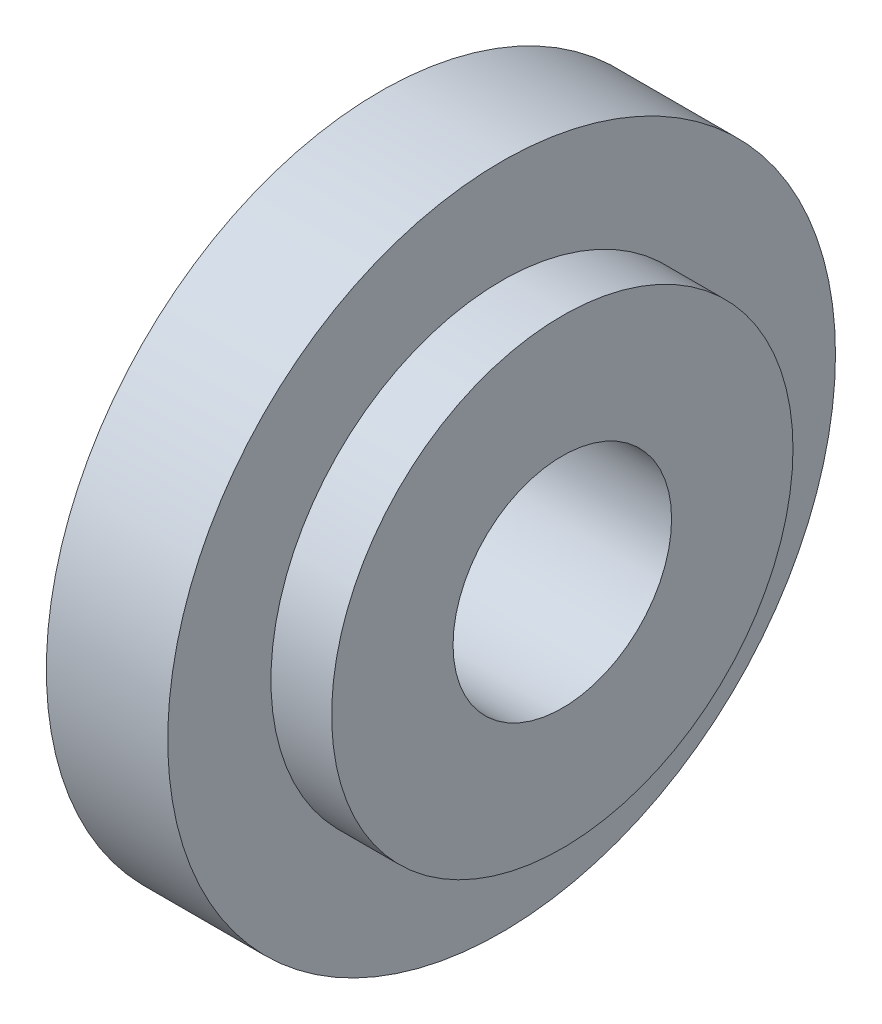
ISO-10303-21;
HEADER;
FILE_DESCRIPTION(('STEP AP214'),'2;1');
FILE_NAME('part.step','',(''),(''),'','','');
FILE_SCHEMA(('AUTOMOTIVE_DESIGN { 1 0 10303 214 1 1 1 1 }'));
ENDSEC;
DATA;
#1=APPLICATION_CONTEXT('core data for automotive mechanical design processes');
#2=APPLICATION_PROTOCOL_DEFINITION('international standard','automotive_design',2000,#1);
#3=PRODUCT_CONTEXT('',#1,'mechanical');
#4=PRODUCT('Part','Part','',(#3));
#5=PRODUCT_RELATED_PRODUCT_CATEGORY('part','',(#4));
#6=PRODUCT_DEFINITION_FORMATION('','',#4);
#7=PRODUCT_DEFINITION_CONTEXT('part definition',#1,'design');
#8=PRODUCT_DEFINITION('design','',#6,#7);
#9=PRODUCT_DEFINITION_SHAPE('','',#8);
#10=(LENGTH_UNIT() NAMED_UNIT(*) SI_UNIT(.MILLI.,.METRE.));
#11=(NAMED_UNIT(*) PLANE_ANGLE_UNIT() SI_UNIT($,.RADIAN.));
#12=(NAMED_UNIT(*) SI_UNIT($,.STERADIAN.) SOLID_ANGLE_UNIT());
#13=UNCERTAINTY_MEASURE_WITH_UNIT(LENGTH_MEASURE(1.E-05),#10,'distance_accuracy_value','');
#14=(GEOMETRIC_REPRESENTATION_CONTEXT(3) GLOBAL_UNCERTAINTY_ASSIGNED_CONTEXT((#13)) GLOBAL_UNIT_ASSIGNED_CONTEXT((#10,
#11,#12)) REPRESENTATION_CONTEXT('',''));
#15=CARTESIAN_POINT('',(0.,0.,0.));
#16=DIRECTION('',(0.,0.,1.));
#17=DIRECTION('',(1.,0.,0.));
#18=AXIS2_PLACEMENT_3D('',#15,#16,#17);
#19=CARTESIAN_POINT('',(2.,0.,0.));
#20=DIRECTION('',(-1.,0.,0.));
#21=DIRECTION('',(0.,0.,1.));
#22=AXIS2_PLACEMENT_3D('',#19,#20,#21);
#23=CYLINDRICAL_SURFACE('',#22,5.5);
#24=CARTESIAN_POINT('',(2.,0.,0.));
#25=DIRECTION('',(1.,0.,0.));
#26=DIRECTION('',(0.,0.,-1.));
#27=AXIS2_PLACEMENT_3D('',#24,#25,#26);
#28=CIRCLE('',#27,5.5);
#29=CARTESIAN_POINT('',(2.,0.,-5.5));
#30=VERTEX_POINT('',#29);
#31=EDGE_CURVE('E45',#30,#30,#28,.T.);
#32=ORIENTED_EDGE('',*,*,#31,.F.);
#33=EDGE_LOOP('',(#32));
#34=FACE_BOUND('',#33,.T.);
#35=CARTESIAN_POINT('',(0.,0.,0.));
#36=DIRECTION('',(1.,0.,0.));
#37=DIRECTION('',(0.,0.,-1.));
#38=AXIS2_PLACEMENT_3D('',#35,#36,#37);
#39=CIRCLE('',#38,5.5);
#40=CARTESIAN_POINT('',(0.,0.,-5.5));
#41=VERTEX_POINT('',#40);
#42=EDGE_CURVE('E51',#41,#41,#39,.T.);
#43=ORIENTED_EDGE('',*,*,#42,.T.);
#44=EDGE_LOOP('',(#43));
#45=FACE_BOUND('',#44,.T.);
#46=ADVANCED_FACE('F37',(#34,#45),#23,.T.);
#47=CARTESIAN_POINT('',(2.,0.,0.));
#48=DIRECTION('',(1.,0.,0.));
#49=DIRECTION('',(0.,0.,-1.));
#50=AXIS2_PLACEMENT_3D('',#47,#48,#49);
#51=PLANE('',#50);
#52=CARTESIAN_POINT('',(2.,0.,0.));
#53=DIRECTION('',(1.,0.,0.));
#54=DIRECTION('',(0.,0.,-1.));
#55=AXIS2_PLACEMENT_3D('',#52,#53,#54);
#56=CIRCLE('',#55,3.8);
#57=CARTESIAN_POINT('',(2.,0.,-3.8));
#58=VERTEX_POINT('',#57);
#59=EDGE_CURVE('E10',#58,#58,#56,.T.);
#60=ORIENTED_EDGE('',*,*,#59,.F.);
#61=EDGE_LOOP('',(#60));
#62=FACE_BOUND('',#61,.T.);
#63=ORIENTED_EDGE('',*,*,#31,.T.);
#64=EDGE_LOOP('',(#63));
#65=FACE_BOUND('',#64,.T.);
#66=ADVANCED_FACE('F79',(#62,#65),#51,.T.);
#67=CARTESIAN_POINT('',(0.,0.,0.));
#68=DIRECTION('',(1.,0.,0.));
#69=DIRECTION('',(0.,0.,-1.));
#70=AXIS2_PLACEMENT_3D('',#67,#68,#69);
#71=PLANE('',#70);
#72=CARTESIAN_POINT('',(0.,0.,0.));
#73=DIRECTION('',(-1.,0.,0.));
#74=DIRECTION('',(0.,0.,1.));
#75=AXIS2_PLACEMENT_3D('',#72,#73,#74);
#76=CIRCLE('',#75,1.8);
#77=CARTESIAN_POINT('',(0.,0.,1.8));
#78=VERTEX_POINT('',#77);
#79=EDGE_CURVE('E66',#78,#78,#76,.T.);
#80=ORIENTED_EDGE('',*,*,#79,.F.);
#81=EDGE_LOOP('',(#80));
#82=FACE_BOUND('',#81,.T.);
#83=ORIENTED_EDGE('',*,*,#42,.F.);
#84=EDGE_LOOP('',(#83));
#85=FACE_BOUND('',#84,.T.);
#86=ADVANCED_FACE('F75',(#82,#85),#71,.F.);
#87=CARTESIAN_POINT('',(3.,0.,0.));
#88=DIRECTION('',(-1.,0.,0.));
#89=DIRECTION('',(0.,0.,1.));
#90=AXIS2_PLACEMENT_3D('',#87,#88,#89);
#91=CYLINDRICAL_SURFACE('',#90,3.8);
#92=CARTESIAN_POINT('',(3.,0.,0.));
#93=DIRECTION('',(1.,0.,0.));
#94=DIRECTION('',(0.,0.,-1.));
#95=AXIS2_PLACEMENT_3D('',#92,#93,#94);
#96=CIRCLE('',#95,3.8);
#97=CARTESIAN_POINT('',(3.,0.,-3.8));
#98=VERTEX_POINT('',#97);
#99=EDGE_CURVE('E54',#98,#98,#96,.T.);
#100=ORIENTED_EDGE('',*,*,#99,.F.);
#101=EDGE_LOOP('',(#100));
#102=FACE_BOUND('',#101,.T.);
#103=ORIENTED_EDGE('',*,*,#59,.T.);
#104=EDGE_LOOP('',(#103));
#105=FACE_BOUND('',#104,.T.);
#106=ADVANCED_FACE('F78',(#102,#105),#91,.T.);
#107=CARTESIAN_POINT('',(3.,0.,0.));
#108=DIRECTION('',(1.,0.,0.));
#109=DIRECTION('',(0.,0.,-1.));
#110=AXIS2_PLACEMENT_3D('',#107,#108,#109);
#111=PLANE('',#110);
#112=CARTESIAN_POINT('',(3.,0.,0.));
#113=DIRECTION('',(1.,0.,0.));
#114=DIRECTION('',(0.,0.,-1.));
#115=AXIS2_PLACEMENT_3D('',#112,#113,#114);
#116=CIRCLE('',#115,1.8);
#117=CARTESIAN_POINT('',(3.,0.,-1.8));
#118=VERTEX_POINT('',#117);
#119=EDGE_CURVE('E40',#118,#118,#116,.T.);
#120=ORIENTED_EDGE('',*,*,#119,.F.);
#121=EDGE_LOOP('',(#120));
#122=FACE_BOUND('',#121,.T.);
#123=ORIENTED_EDGE('',*,*,#99,.T.);
#124=EDGE_LOOP('',(#123));
#125=FACE_BOUND('',#124,.T.);
#126=ADVANCED_FACE('F84',(#122,#125),#111,.T.);
#127=CARTESIAN_POINT('',(20.,0.,0.));
#128=DIRECTION('',(-1.,0.,0.));
#129=DIRECTION('',(0.,0.,1.));
#130=AXIS2_PLACEMENT_3D('',#127,#128,#129);
#131=CYLINDRICAL_SURFACE('',#130,1.8);
#132=ORIENTED_EDGE('',*,*,#119,.T.);
#133=EDGE_LOOP('',(#132));
#134=FACE_BOUND('',#133,.T.);
#135=ORIENTED_EDGE('',*,*,#79,.T.);
#136=EDGE_LOOP('',(#135));
#137=FACE_BOUND('',#136,.T.);
#138=ADVANCED_FACE('F73',(#134,#137),#131,.F.);
#139=CLOSED_SHELL('',(#46,#66,#86,#106,#126,#138));
#140=MANIFOLD_SOLID_BREP('B2',#139);
#141=ADVANCED_BREP_SHAPE_REPRESENTATION('',(#18,#140),#14);
#142=SHAPE_DEFINITION_REPRESENTATION(#9,#141);
ENDSEC;
END-ISO-10303-21;
